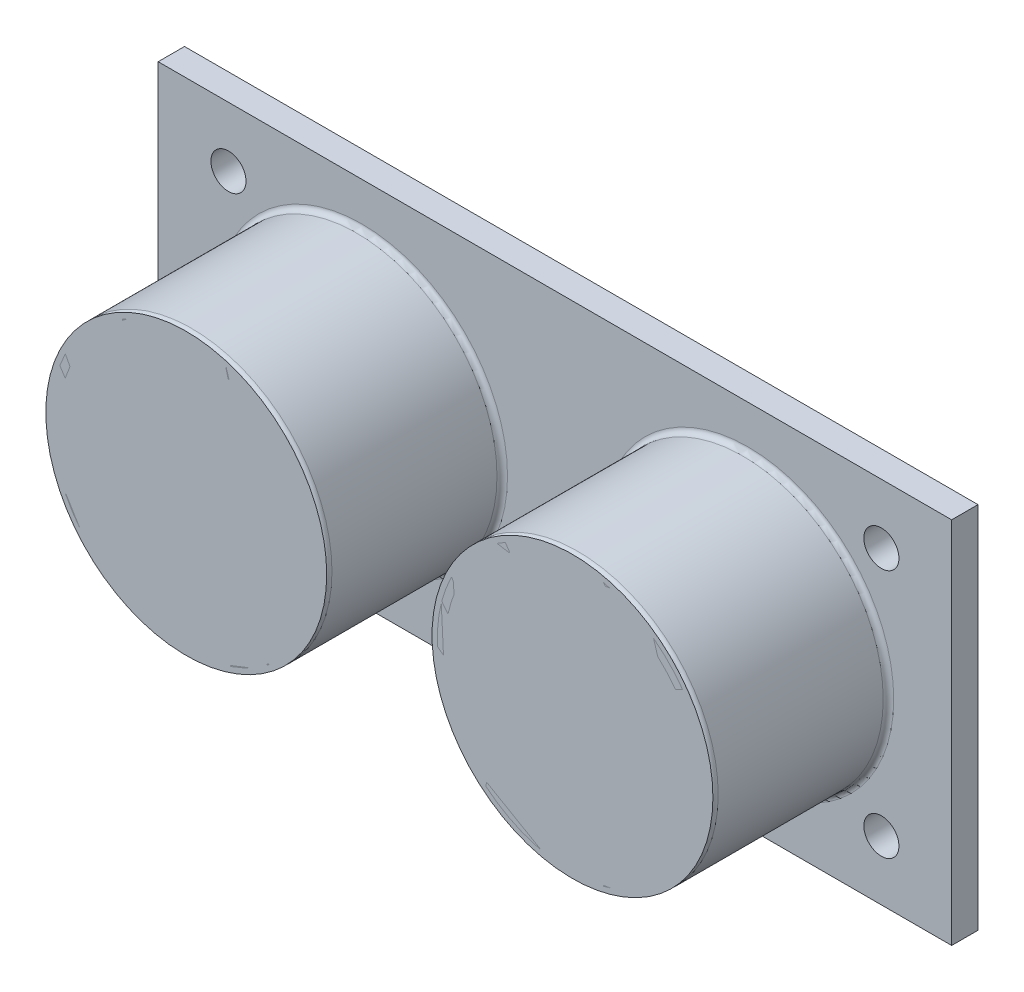
ISO-10303-21;
HEADER;
FILE_DESCRIPTION(('STEP AP214'),'2;1');
FILE_NAME('part.step','',(''),(''),'','','');
FILE_SCHEMA(('AUTOMOTIVE_DESIGN { 1 0 10303 214 1 1 1 1 }'));
ENDSEC;
DATA;
#1=APPLICATION_CONTEXT('core data for automotive mechanical design processes');
#2=APPLICATION_PROTOCOL_DEFINITION('international standard','automotive_design',2000,#1);
#3=PRODUCT_CONTEXT('',#1,'mechanical');
#4=PRODUCT('Part','Part','',(#3));
#5=PRODUCT_RELATED_PRODUCT_CATEGORY('part','',(#4));
#6=PRODUCT_DEFINITION_FORMATION('','',#4);
#7=PRODUCT_DEFINITION_CONTEXT('part definition',#1,'design');
#8=PRODUCT_DEFINITION('design','',#6,#7);
#9=PRODUCT_DEFINITION_SHAPE('','',#8);
#10=(LENGTH_UNIT() NAMED_UNIT(*) SI_UNIT(.MILLI.,.METRE.));
#11=(NAMED_UNIT(*) PLANE_ANGLE_UNIT() SI_UNIT($,.RADIAN.));
#12=(NAMED_UNIT(*) SI_UNIT($,.STERADIAN.) SOLID_ANGLE_UNIT());
#13=UNCERTAINTY_MEASURE_WITH_UNIT(LENGTH_MEASURE(1.E-05),#10,'distance_accuracy_value','');
#14=(GEOMETRIC_REPRESENTATION_CONTEXT(3) GLOBAL_UNCERTAINTY_ASSIGNED_CONTEXT((#13)) GLOBAL_UNIT_ASSIGNED_CONTEXT((#10,
#11,#12)) REPRESENTATION_CONTEXT('',''));
#15=CARTESIAN_POINT('',(0.,0.,0.));
#16=DIRECTION('',(0.,0.,1.));
#17=DIRECTION('',(1.,0.,0.));
#18=AXIS2_PLACEMENT_3D('',#15,#16,#17);
#19=CARTESIAN_POINT('',(0.,0.,10.75));
#20=DIRECTION('',(0.,0.,1.));
#21=DIRECTION('',(1.,0.,0.));
#22=AXIS2_PLACEMENT_3D('',#19,#20,#21);
#23=PLANE('',#22);
#24=CARTESIAN_POINT('',(11.,0.,10.75));
#25=DIRECTION('',(0.,0.,1.));
#26=DIRECTION('',(1.,0.,0.));
#27=AXIS2_PLACEMENT_3D('',#24,#25,#26);
#28=CIRCLE('',#27,8.);
#29=CARTESIAN_POINT('',(19.,0.,10.75));
#30=VERTEX_POINT('',#29);
#31=EDGE_CURVE('E13',#30,#30,#28,.T.);
#32=ORIENTED_EDGE('',*,*,#31,.T.);
#33=EDGE_LOOP('',(#32));
#34=FACE_BOUND('',#33,.T.);
#35=ADVANCED_FACE('F51',(#34),#23,.T.);
#36=OPEN_SHELL('',(#35));
#37=SHELL_BASED_SURFACE_MODEL('B2',(#36));
#38=CARTESIAN_POINT('',(0.,0.,10.75));
#39=DIRECTION('',(0.,0.,1.));
#40=DIRECTION('',(1.,0.,0.));
#41=AXIS2_PLACEMENT_3D('',#38,#39,#40);
#42=PLANE('',#41);
#43=CARTESIAN_POINT('',(-11.,0.,10.75));
#44=DIRECTION('',(0.,0.,1.));
#45=DIRECTION('',(1.,0.,0.));
#46=AXIS2_PLACEMENT_3D('',#43,#44,#45);
#47=CIRCLE('',#46,8.);
#48=CARTESIAN_POINT('',(-3.,0.,10.75));
#49=VERTEX_POINT('',#48);
#50=EDGE_CURVE('E50',#49,#49,#47,.T.);
#51=ORIENTED_EDGE('',*,*,#50,.T.);
#52=EDGE_LOOP('',(#51));
#53=FACE_BOUND('',#52,.T.);
#54=ADVANCED_FACE('F76',(#53),#42,.T.);
#55=OPEN_SHELL('',(#54));
#56=SHELL_BASED_SURFACE_MODEL('B8',(#55));
#57=CARTESIAN_POINT('',(22.6,10.5,0.75));
#58=DIRECTION('',(-1.,0.,0.));
#59=DIRECTION('',(0.,0.,1.));
#60=AXIS2_PLACEMENT_3D('',#57,#58,#59);
#61=PLANE('',#60);
#62=DIRECTION('',(0.,1.,0.));
#63=VECTOR('',#62,1.);
#64=CARTESIAN_POINT('',(22.6,10.5,-0.75));
#65=LINE('',#64,#63);
#66=CARTESIAN_POINT('',(22.6,-10.5,-0.75));
#67=VERTEX_POINT('',#66);
#68=CARTESIAN_POINT('',(22.6,10.5,-0.75));
#69=VERTEX_POINT('',#68);
#70=EDGE_CURVE('E160',#67,#69,#65,.T.);
#71=ORIENTED_EDGE('',*,*,#70,.T.);
#72=DIRECTION('',(0.,0.,-1.));
#73=VECTOR('',#72,1.);
#74=CARTESIAN_POINT('',(22.6,10.5,0.75));
#75=LINE('',#74,#73);
#76=CARTESIAN_POINT('',(22.6,10.5,0.75));
#77=VERTEX_POINT('',#76);
#78=EDGE_CURVE('E151',#77,#69,#75,.T.);
#79=ORIENTED_EDGE('',*,*,#78,.F.);
#80=DIRECTION('',(0.,1.,0.));
#81=VECTOR('',#80,1.);
#82=CARTESIAN_POINT('',(22.6,10.5,0.75));
#83=LINE('',#82,#81);
#84=CARTESIAN_POINT('',(22.6,-10.5,0.75));
#85=VERTEX_POINT('',#84);
#86=EDGE_CURVE('E145',#85,#77,#83,.T.);
#87=ORIENTED_EDGE('',*,*,#86,.F.);
#88=DIRECTION('',(0.,0.,-1.));
#89=VECTOR('',#88,1.);
#90=CARTESIAN_POINT('',(22.6,-10.5,0.75));
#91=LINE('',#90,#89);
#92=EDGE_CURVE('E156',#85,#67,#91,.T.);
#93=ORIENTED_EDGE('',*,*,#92,.T.);
#94=EDGE_LOOP('',(#71,#79,#87,#93));
#95=FACE_BOUND('',#94,.T.);
#96=ADVANCED_FACE('F92',(#95),#61,.F.);
#97=CARTESIAN_POINT('',(-22.6,10.5,0.75));
#98=DIRECTION('',(0.,-1.,0.));
#99=DIRECTION('',(1.,0.,0.));
#100=AXIS2_PLACEMENT_3D('',#97,#98,#99);
#101=PLANE('',#100);
#102=DIRECTION('',(-1.,0.,0.));
#103=VECTOR('',#102,1.);
#104=CARTESIAN_POINT('',(-22.6,10.5,-0.75));
#105=LINE('',#104,#103);
#106=CARTESIAN_POINT('',(-22.6,10.5,-0.75));
#107=VERTEX_POINT('',#106);
#108=EDGE_CURVE('E150',#69,#107,#105,.T.);
#109=ORIENTED_EDGE('',*,*,#108,.T.);
#110=DIRECTION('',(0.,0.,-1.));
#111=VECTOR('',#110,1.);
#112=CARTESIAN_POINT('',(-22.6,10.5,0.75));
#113=LINE('',#112,#111);
#114=CARTESIAN_POINT('',(-22.6,10.5,0.75));
#115=VERTEX_POINT('',#114);
#116=EDGE_CURVE('E148',#115,#107,#113,.T.);
#117=ORIENTED_EDGE('',*,*,#116,.F.);
#118=DIRECTION('',(-1.,0.,0.));
#119=VECTOR('',#118,1.);
#120=CARTESIAN_POINT('',(-22.6,10.5,0.75));
#121=LINE('',#120,#119);
#122=EDGE_CURVE('E140',#77,#115,#121,.T.);
#123=ORIENTED_EDGE('',*,*,#122,.F.);
#124=ORIENTED_EDGE('',*,*,#78,.T.);
#125=EDGE_LOOP('',(#109,#117,#123,#124));
#126=FACE_BOUND('',#125,.T.);
#127=ADVANCED_FACE('F149',(#126),#101,.F.);
#128=CARTESIAN_POINT('',(-22.6,10.5,0.75));
#129=DIRECTION('',(1.,0.,0.));
#130=DIRECTION('',(0.,0.,-1.));
#131=AXIS2_PLACEMENT_3D('',#128,#129,#130);
#132=PLANE('',#131);
#133=DIRECTION('',(0.,-1.,0.));
#134=VECTOR('',#133,1.);
#135=CARTESIAN_POINT('',(-22.6,10.5,-0.75));
#136=LINE('',#135,#134);
#137=CARTESIAN_POINT('',(-22.6,-10.5,-0.75));
#138=VERTEX_POINT('',#137);
#139=EDGE_CURVE('E126',#107,#138,#136,.T.);
#140=ORIENTED_EDGE('',*,*,#139,.T.);
#141=DIRECTION('',(0.,0.,-1.));
#142=VECTOR('',#141,1.);
#143=CARTESIAN_POINT('',(-22.6,-10.5,0.75));
#144=LINE('',#143,#142);
#145=CARTESIAN_POINT('',(-22.6,-10.5,0.75));
#146=VERTEX_POINT('',#145);
#147=EDGE_CURVE('E152',#146,#138,#144,.T.);
#148=ORIENTED_EDGE('',*,*,#147,.F.);
#149=DIRECTION('',(0.,-1.,0.));
#150=VECTOR('',#149,1.);
#151=CARTESIAN_POINT('',(-22.6,10.5,0.75));
#152=LINE('',#151,#150);
#153=EDGE_CURVE('E143',#115,#146,#152,.T.);
#154=ORIENTED_EDGE('',*,*,#153,.F.);
#155=ORIENTED_EDGE('',*,*,#116,.T.);
#156=EDGE_LOOP('',(#140,#148,#154,#155));
#157=FACE_BOUND('',#156,.T.);
#158=ADVANCED_FACE('F154',(#157),#132,.F.);
#159=CARTESIAN_POINT('',(-22.6,-10.5,0.75));
#160=DIRECTION('',(0.,1.,0.));
#161=DIRECTION('',(0.,0.,1.));
#162=AXIS2_PLACEMENT_3D('',#159,#160,#161);
#163=PLANE('',#162);
#164=DIRECTION('',(1.,0.,0.));
#165=VECTOR('',#164,1.);
#166=CARTESIAN_POINT('',(-22.6,-10.5,-0.75));
#167=LINE('',#166,#165);
#168=EDGE_CURVE('E132',#138,#67,#167,.T.);
#169=ORIENTED_EDGE('',*,*,#168,.T.);
#170=ORIENTED_EDGE('',*,*,#92,.F.);
#171=DIRECTION('',(1.,0.,0.));
#172=VECTOR('',#171,1.);
#173=CARTESIAN_POINT('',(-22.6,-10.5,0.75));
#174=LINE('',#173,#172);
#175=EDGE_CURVE('E109',#146,#85,#174,.T.);
#176=ORIENTED_EDGE('',*,*,#175,.F.);
#177=ORIENTED_EDGE('',*,*,#147,.T.);
#178=EDGE_LOOP('',(#169,#170,#176,#177));
#179=FACE_BOUND('',#178,.T.);
#180=ADVANCED_FACE('F249',(#179),#163,.F.);
#181=CARTESIAN_POINT('',(0.,0.,0.75));
#182=DIRECTION('',(0.,0.,1.));
#183=DIRECTION('',(1.,0.,0.));
#184=AXIS2_PLACEMENT_3D('',#181,#182,#183);
#185=PLANE('',#184);
#186=CARTESIAN_POINT('',(11.,0.,0.75));
#187=DIRECTION('',(0.,0.,1.));
#188=DIRECTION('',(1.,0.,0.));
#189=AXIS2_PLACEMENT_3D('',#186,#187,#188);
#190=CIRCLE('',#189,8.3);
#191=CARTESIAN_POINT('',(19.3,0.,0.75));
#192=VERTEX_POINT('',#191);
#193=EDGE_CURVE('E182',#192,#192,#190,.F.);
#194=ORIENTED_EDGE('',*,*,#193,.T.);
#195=EDGE_LOOP('',(#194));
#196=FACE_BOUND('',#195,.T.);
#197=CARTESIAN_POINT('',(-11.,0.,0.75));
#198=DIRECTION('',(0.,0.,1.));
#199=DIRECTION('',(1.,0.,0.));
#200=AXIS2_PLACEMENT_3D('',#197,#198,#199);
#201=CIRCLE('',#200,8.3);
#202=CARTESIAN_POINT('',(-2.7,0.,0.75));
#203=VERTEX_POINT('',#202);
#204=EDGE_CURVE('E179',#203,#203,#201,.F.);
#205=ORIENTED_EDGE('',*,*,#204,.T.);
#206=EDGE_LOOP('',(#205));
#207=FACE_BOUND('',#206,.T.);
#208=CARTESIAN_POINT('',(-18.5965477568025,-7.09919625163283,0.75));
#209=DIRECTION('',(0.,0.,-1.));
#210=DIRECTION('',(1.,0.,0.));
#211=AXIS2_PLACEMENT_3D('',#208,#209,#210);
#212=CIRCLE('',#211,1.);
#213=CARTESIAN_POINT('',(-17.5965477568025,-7.09919625163283,0.75));
#214=VERTEX_POINT('',#213);
#215=EDGE_CURVE('E215',#214,#214,#212,.T.);
#216=ORIENTED_EDGE('',*,*,#215,.T.);
#217=EDGE_LOOP('',(#216));
#218=FACE_BOUND('',#217,.T.);
#219=CARTESIAN_POINT('',(18.5965477568025,-7.09919625163283,0.75));
#220=DIRECTION('',(0.,0.,1.));
#221=DIRECTION('',(-1.,0.,0.));
#222=AXIS2_PLACEMENT_3D('',#219,#220,#221);
#223=CIRCLE('',#222,1.);
#224=CARTESIAN_POINT('',(17.5965477568025,-7.09919625163283,0.75));
#225=VERTEX_POINT('',#224);
#226=EDGE_CURVE('E225',#225,#225,#223,.T.);
#227=ORIENTED_EDGE('',*,*,#226,.F.);
#228=EDGE_LOOP('',(#227));
#229=FACE_BOUND('',#228,.T.);
#230=CARTESIAN_POINT('',(18.5965477568025,7.09919625163283,0.75));
#231=DIRECTION('',(0.,0.,-1.));
#232=DIRECTION('',(-1.,0.,0.));
#233=AXIS2_PLACEMENT_3D('',#230,#231,#232);
#234=CIRCLE('',#233,1.);
#235=CARTESIAN_POINT('',(17.5965477568025,7.09919625163283,0.75));
#236=VERTEX_POINT('',#235);
#237=EDGE_CURVE('E231',#236,#236,#234,.T.);
#238=ORIENTED_EDGE('',*,*,#237,.T.);
#239=EDGE_LOOP('',(#238));
#240=FACE_BOUND('',#239,.T.);
#241=CARTESIAN_POINT('',(-18.5965477568025,7.09919625163283,0.75));
#242=DIRECTION('',(0.,0.,1.));
#243=DIRECTION('',(1.,0.,0.));
#244=AXIS2_PLACEMENT_3D('',#241,#242,#243);
#245=CIRCLE('',#244,1.);
#246=CARTESIAN_POINT('',(-17.5965477568025,7.09919625163283,0.75));
#247=VERTEX_POINT('',#246);
#248=EDGE_CURVE('E237',#247,#247,#245,.T.);
#249=ORIENTED_EDGE('',*,*,#248,.F.);
#250=EDGE_LOOP('',(#249));
#251=FACE_BOUND('',#250,.T.);
#252=ORIENTED_EDGE('',*,*,#86,.T.);
#253=ORIENTED_EDGE('',*,*,#122,.T.);
#254=ORIENTED_EDGE('',*,*,#153,.T.);
#255=ORIENTED_EDGE('',*,*,#175,.T.);
#256=EDGE_LOOP('',(#252,#253,#254,#255));
#257=FACE_BOUND('',#256,.T.);
#258=ADVANCED_FACE('F141',(#196,#207,#218,#229,#240,#251,#257),#185,.T.);
#259=CARTESIAN_POINT('',(0.,0.,-0.75));
#260=DIRECTION('',(0.,0.,1.));
#261=DIRECTION('',(1.,0.,0.));
#262=AXIS2_PLACEMENT_3D('',#259,#260,#261);
#263=PLANE('',#262);
#264=CARTESIAN_POINT('',(-18.5965477568025,-7.09919625163283,-0.75));
#265=DIRECTION('',(0.,0.,-1.));
#266=DIRECTION('',(1.,0.,0.));
#267=AXIS2_PLACEMENT_3D('',#264,#265,#266);
#268=CIRCLE('',#267,1.);
#269=CARTESIAN_POINT('',(-17.5965477568025,-7.09919625163283,-0.75));
#270=VERTEX_POINT('',#269);
#271=EDGE_CURVE('E222',#270,#270,#268,.T.);
#272=ORIENTED_EDGE('',*,*,#271,.F.);
#273=EDGE_LOOP('',(#272));
#274=FACE_BOUND('',#273,.T.);
#275=CARTESIAN_POINT('',(18.5965477568025,-7.09919625163283,-0.75));
#276=DIRECTION('',(0.,0.,1.));
#277=DIRECTION('',(-1.,0.,0.));
#278=AXIS2_PLACEMENT_3D('',#275,#276,#277);
#279=CIRCLE('',#278,1.);
#280=CARTESIAN_POINT('',(17.5965477568025,-7.09919625163283,-0.75));
#281=VERTEX_POINT('',#280);
#282=EDGE_CURVE('E228',#281,#281,#279,.T.);
#283=ORIENTED_EDGE('',*,*,#282,.T.);
#284=EDGE_LOOP('',(#283));
#285=FACE_BOUND('',#284,.T.);
#286=CARTESIAN_POINT('',(18.5965477568025,7.09919625163283,-0.75));
#287=DIRECTION('',(0.,0.,-1.));
#288=DIRECTION('',(-1.,0.,0.));
#289=AXIS2_PLACEMENT_3D('',#286,#287,#288);
#290=CIRCLE('',#289,1.);
#291=CARTESIAN_POINT('',(17.5965477568025,7.09919625163283,-0.75));
#292=VERTEX_POINT('',#291);
#293=EDGE_CURVE('E234',#292,#292,#290,.T.);
#294=ORIENTED_EDGE('',*,*,#293,.F.);
#295=EDGE_LOOP('',(#294));
#296=FACE_BOUND('',#295,.T.);
#297=CARTESIAN_POINT('',(-18.5965477568025,7.09919625163283,-0.75));
#298=DIRECTION('',(0.,0.,1.));
#299=DIRECTION('',(1.,0.,0.));
#300=AXIS2_PLACEMENT_3D('',#297,#298,#299);
#301=CIRCLE('',#300,1.);
#302=CARTESIAN_POINT('',(-17.5965477568025,7.09919625163283,-0.75));
#303=VERTEX_POINT('',#302);
#304=EDGE_CURVE('E163',#303,#303,#301,.T.);
#305=ORIENTED_EDGE('',*,*,#304,.T.);
#306=EDGE_LOOP('',(#305));
#307=FACE_BOUND('',#306,.T.);
#308=ORIENTED_EDGE('',*,*,#70,.F.);
#309=ORIENTED_EDGE('',*,*,#168,.F.);
#310=ORIENTED_EDGE('',*,*,#139,.F.);
#311=ORIENTED_EDGE('',*,*,#108,.F.);
#312=EDGE_LOOP('',(#308,#309,#310,#311));
#313=FACE_BOUND('',#312,.T.);
#314=ADVANCED_FACE('F248',(#274,#285,#296,#307,#313),#263,.F.);
#315=CARTESIAN_POINT('',(-18.5965477568025,7.09919625163283,-0.75));
#316=DIRECTION('',(0.,0.,1.));
#317=DIRECTION('',(1.,0.,0.));
#318=AXIS2_PLACEMENT_3D('',#315,#316,#317);
#319=CYLINDRICAL_SURFACE('',#318,1.);
#320=ORIENTED_EDGE('',*,*,#304,.F.);
#321=EDGE_LOOP('',(#320));
#322=FACE_BOUND('',#321,.T.);
#323=ORIENTED_EDGE('',*,*,#248,.T.);
#324=EDGE_LOOP('',(#323));
#325=FACE_BOUND('',#324,.T.);
#326=ADVANCED_FACE('F245',(#322,#325),#319,.F.);
#327=CARTESIAN_POINT('',(18.5965477568025,7.09919625163283,-0.75));
#328=DIRECTION('',(0.,0.,1.));
#329=DIRECTION('',(1.,0.,0.));
#330=AXIS2_PLACEMENT_3D('',#327,#328,#329);
#331=CYLINDRICAL_SURFACE('',#330,1.);
#332=ORIENTED_EDGE('',*,*,#293,.T.);
#333=EDGE_LOOP('',(#332));
#334=FACE_BOUND('',#333,.T.);
#335=ORIENTED_EDGE('',*,*,#237,.F.);
#336=EDGE_LOOP('',(#335));
#337=FACE_BOUND('',#336,.T.);
#338=ADVANCED_FACE('F312',(#334,#337),#331,.F.);
#339=CARTESIAN_POINT('',(18.5965477568025,-7.09919625163283,-0.75));
#340=DIRECTION('',(0.,0.,1.));
#341=DIRECTION('',(1.,0.,0.));
#342=AXIS2_PLACEMENT_3D('',#339,#340,#341);
#343=CYLINDRICAL_SURFACE('',#342,1.);
#344=ORIENTED_EDGE('',*,*,#282,.F.);
#345=EDGE_LOOP('',(#344));
#346=FACE_BOUND('',#345,.T.);
#347=ORIENTED_EDGE('',*,*,#226,.T.);
#348=EDGE_LOOP('',(#347));
#349=FACE_BOUND('',#348,.T.);
#350=ADVANCED_FACE('F308',(#346,#349),#343,.F.);
#351=CARTESIAN_POINT('',(-18.5965477568025,-7.09919625163283,-0.75));
#352=DIRECTION('',(0.,0.,1.));
#353=DIRECTION('',(1.,0.,0.));
#354=AXIS2_PLACEMENT_3D('',#351,#352,#353);
#355=CYLINDRICAL_SURFACE('',#354,1.);
#356=ORIENTED_EDGE('',*,*,#271,.T.);
#357=EDGE_LOOP('',(#356));
#358=FACE_BOUND('',#357,.T.);
#359=ORIENTED_EDGE('',*,*,#215,.F.);
#360=EDGE_LOOP('',(#359));
#361=FACE_BOUND('',#360,.T.);
#362=ADVANCED_FACE('F305',(#358,#361),#355,.F.);
#363=CARTESIAN_POINT('',(-11.,0.,10.75));
#364=DIRECTION('',(0.,0.,-1.));
#365=DIRECTION('',(-1.,0.,0.));
#366=AXIS2_PLACEMENT_3D('',#363,#364,#365);
#367=CYLINDRICAL_SURFACE('',#366,8.);
#368=CARTESIAN_POINT('',(-11.,0.,10.45));
#369=DIRECTION('',(0.,0.,1.));
#370=DIRECTION('',(1.,0.,0.));
#371=AXIS2_PLACEMENT_3D('',#368,#369,#370);
#372=CIRCLE('',#371,8.);
#373=CARTESIAN_POINT('',(-3.,0.,10.45));
#374=VERTEX_POINT('',#373);
#375=EDGE_CURVE('E101',#374,#374,#372,.F.);
#376=ORIENTED_EDGE('',*,*,#375,.T.);
#377=EDGE_LOOP('',(#376));
#378=FACE_BOUND('',#377,.T.);
#379=CARTESIAN_POINT('',(-11.,0.,1.05));
#380=DIRECTION('',(0.,0.,1.));
#381=DIRECTION('',(1.,0.,0.));
#382=AXIS2_PLACEMENT_3D('',#379,#380,#381);
#383=CIRCLE('',#382,8.);
#384=CARTESIAN_POINT('',(-3.,0.,1.05));
#385=VERTEX_POINT('',#384);
#386=EDGE_CURVE('E188',#385,#385,#383,.T.);
#387=ORIENTED_EDGE('',*,*,#386,.T.);
#388=EDGE_LOOP('',(#387));
#389=FACE_BOUND('',#388,.T.);
#390=ADVANCED_FACE('F193',(#378,#389),#367,.T.);
#391=CARTESIAN_POINT('',(-11.,0.,10.75));
#392=DIRECTION('',(0.,0.,1.));
#393=DIRECTION('',(1.,0.,0.));
#394=AXIS2_PLACEMENT_3D('',#391,#392,#393);
#395=PLANE('',#394);
#396=CARTESIAN_POINT('',(-11.,0.,10.75));
#397=DIRECTION('',(0.,0.,1.));
#398=DIRECTION('',(1.,0.,0.));
#399=AXIS2_PLACEMENT_3D('',#396,#397,#398);
#400=CIRCLE('',#399,7.7);
#401=CARTESIAN_POINT('',(-3.3,0.,10.75));
#402=VERTEX_POINT('',#401);
#403=EDGE_CURVE('E185',#402,#402,#400,.T.);
#404=ORIENTED_EDGE('',*,*,#403,.T.);
#405=EDGE_LOOP('',(#404));
#406=FACE_BOUND('',#405,.T.);
#407=CARTESIAN_POINT('',(-11.,0.,10.75));
#408=DIRECTION('',(0.,0.,1.));
#409=DIRECTION('',(1.,0.,0.));
#410=AXIS2_PLACEMENT_3D('',#407,#408,#409);
#411=CIRCLE('',#410,7.25);
#412=CARTESIAN_POINT('',(-3.75,0.,10.75));
#413=VERTEX_POINT('',#412);
#414=EDGE_CURVE('E209',#413,#413,#411,.T.);
#415=ORIENTED_EDGE('',*,*,#414,.F.);
#416=EDGE_LOOP('',(#415));
#417=FACE_BOUND('',#416,.T.);
#418=ADVANCED_FACE('F202',(#406,#417),#395,.T.);
#419=CARTESIAN_POINT('',(-11.,0.,2.75));
#420=DIRECTION('',(0.,0.,1.));
#421=DIRECTION('',(1.,0.,0.));
#422=AXIS2_PLACEMENT_3D('',#419,#420,#421);
#423=CYLINDRICAL_SURFACE('',#422,7.25);
#424=CARTESIAN_POINT('',(-11.,0.,2.75));
#425=DIRECTION('',(0.,0.,1.));
#426=DIRECTION('',(1.,0.,0.));
#427=AXIS2_PLACEMENT_3D('',#424,#425,#426);
#428=CIRCLE('',#427,7.25);
#429=CARTESIAN_POINT('',(-3.75,0.,2.75));
#430=VERTEX_POINT('',#429);
#431=EDGE_CURVE('E211',#430,#430,#428,.T.);
#432=ORIENTED_EDGE('',*,*,#431,.F.);
#433=EDGE_LOOP('',(#432));
#434=FACE_BOUND('',#433,.T.);
#435=ORIENTED_EDGE('',*,*,#414,.T.);
#436=EDGE_LOOP('',(#435));
#437=FACE_BOUND('',#436,.T.);
#438=ADVANCED_FACE('F205',(#434,#437),#423,.F.);
#439=CARTESIAN_POINT('',(-11.,0.,2.75));
#440=DIRECTION('',(0.,0.,1.));
#441=DIRECTION('',(1.,0.,0.));
#442=AXIS2_PLACEMENT_3D('',#439,#440,#441);
#443=PLANE('',#442);
#444=CARTESIAN_POINT('',(-11.,0.,2.75));
#445=DIRECTION('',(0.,0.,1.));
#446=DIRECTION('',(1.,0.,0.));
#447=AXIS2_PLACEMENT_3D('',#444,#445,#446);
#448=CIRCLE('',#447,5.6);
#449=CARTESIAN_POINT('',(-5.4,0.,2.75));
#450=VERTEX_POINT('',#449);
#451=EDGE_CURVE('E430',#450,#450,#448,.T.);
#452=ORIENTED_EDGE('',*,*,#451,.F.);
#453=EDGE_LOOP('',(#452));
#454=FACE_BOUND('',#453,.T.);
#455=ORIENTED_EDGE('',*,*,#431,.T.);
#456=EDGE_LOOP('',(#455));
#457=FACE_BOUND('',#456,.T.);
#458=ADVANCED_FACE('F286',(#454,#457),#443,.T.);
#459=CARTESIAN_POINT('',(11.,0.,10.75));
#460=DIRECTION('',(0.,0.,-1.));
#461=DIRECTION('',(-1.,0.,0.));
#462=AXIS2_PLACEMENT_3D('',#459,#460,#461);
#463=CYLINDRICAL_SURFACE('',#462,8.);
#464=CARTESIAN_POINT('',(11.,0.,10.45));
#465=DIRECTION('',(0.,0.,1.));
#466=DIRECTION('',(1.,0.,0.));
#467=AXIS2_PLACEMENT_3D('',#464,#465,#466);
#468=CIRCLE('',#467,8.);
#469=CARTESIAN_POINT('',(19.,0.,10.45));
#470=VERTEX_POINT('',#469);
#471=EDGE_CURVE('E173',#470,#470,#468,.F.);
#472=ORIENTED_EDGE('',*,*,#471,.T.);
#473=EDGE_LOOP('',(#472));
#474=FACE_BOUND('',#473,.T.);
#475=CARTESIAN_POINT('',(11.,0.,1.05));
#476=DIRECTION('',(0.,0.,1.));
#477=DIRECTION('',(1.,0.,0.));
#478=AXIS2_PLACEMENT_3D('',#475,#476,#477);
#479=CIRCLE('',#478,8.);
#480=CARTESIAN_POINT('',(19.,0.,1.05));
#481=VERTEX_POINT('',#480);
#482=EDGE_CURVE('E170',#481,#481,#479,.T.);
#483=ORIENTED_EDGE('',*,*,#482,.T.);
#484=EDGE_LOOP('',(#483));
#485=FACE_BOUND('',#484,.T.);
#486=ADVANCED_FACE('F283',(#474,#485),#463,.T.);
#487=CARTESIAN_POINT('',(11.,0.,10.75));
#488=DIRECTION('',(0.,0.,1.));
#489=DIRECTION('',(-1.,0.,0.));
#490=AXIS2_PLACEMENT_3D('',#487,#488,#489);
#491=PLANE('',#490);
#492=CARTESIAN_POINT('',(11.,0.,10.75));
#493=DIRECTION('',(0.,0.,1.));
#494=DIRECTION('',(1.,0.,0.));
#495=AXIS2_PLACEMENT_3D('',#492,#493,#494);
#496=CIRCLE('',#495,7.7);
#497=CARTESIAN_POINT('',(18.7,0.,10.75));
#498=VERTEX_POINT('',#497);
#499=EDGE_CURVE('E176',#498,#498,#496,.T.);
#500=ORIENTED_EDGE('',*,*,#499,.T.);
#501=EDGE_LOOP('',(#500));
#502=FACE_BOUND('',#501,.T.);
#503=CARTESIAN_POINT('',(11.,0.,10.75));
#504=DIRECTION('',(0.,0.,-1.));
#505=DIRECTION('',(-1.,0.,0.));
#506=AXIS2_PLACEMENT_3D('',#503,#504,#505);
#507=CIRCLE('',#506,7.25);
#508=CARTESIAN_POINT('',(3.75,0.,10.75));
#509=VERTEX_POINT('',#508);
#510=EDGE_CURVE('E218',#509,#509,#507,.T.);
#511=ORIENTED_EDGE('',*,*,#510,.T.);
#512=EDGE_LOOP('',(#511));
#513=FACE_BOUND('',#512,.T.);
#514=ADVANCED_FACE('F285',(#502,#513),#491,.T.);
#515=CARTESIAN_POINT('',(11.,0.,2.75));
#516=DIRECTION('',(0.,0.,1.));
#517=DIRECTION('',(1.,0.,0.));
#518=AXIS2_PLACEMENT_3D('',#515,#516,#517);
#519=CYLINDRICAL_SURFACE('',#518,7.25);
#520=CARTESIAN_POINT('',(11.,0.,2.75));
#521=DIRECTION('',(0.,0.,-1.));
#522=DIRECTION('',(-1.,0.,0.));
#523=AXIS2_PLACEMENT_3D('',#520,#521,#522);
#524=CIRCLE('',#523,7.25);
#525=CARTESIAN_POINT('',(3.75,0.,2.75));
#526=VERTEX_POINT('',#525);
#527=EDGE_CURVE('E212',#526,#526,#524,.T.);
#528=ORIENTED_EDGE('',*,*,#527,.T.);
#529=EDGE_LOOP('',(#528));
#530=FACE_BOUND('',#529,.T.);
#531=ORIENTED_EDGE('',*,*,#510,.F.);
#532=EDGE_LOOP('',(#531));
#533=FACE_BOUND('',#532,.T.);
#534=ADVANCED_FACE('F293',(#530,#533),#519,.F.);
#535=CARTESIAN_POINT('',(11.,0.,2.75));
#536=DIRECTION('',(0.,0.,1.));
#537=DIRECTION('',(-1.,0.,0.));
#538=AXIS2_PLACEMENT_3D('',#535,#536,#537);
#539=PLANE('',#538);
#540=CARTESIAN_POINT('',(11.,0.,2.75));
#541=DIRECTION('',(0.,0.,1.));
#542=DIRECTION('',(1.,0.,0.));
#543=AXIS2_PLACEMENT_3D('',#540,#541,#542);
#544=CIRCLE('',#543,5.6);
#545=CARTESIAN_POINT('',(16.6,0.,2.75));
#546=VERTEX_POINT('',#545);
#547=EDGE_CURVE('E74',#546,#546,#544,.T.);
#548=ORIENTED_EDGE('',*,*,#547,.F.);
#549=EDGE_LOOP('',(#548));
#550=FACE_BOUND('',#549,.T.);
#551=ORIENTED_EDGE('',*,*,#527,.F.);
#552=EDGE_LOOP('',(#551));
#553=FACE_BOUND('',#552,.T.);
#554=ADVANCED_FACE('F273',(#550,#553),#539,.T.);
#555=CARTESIAN_POINT('',(11.,0.,10.45));
#556=DIRECTION('',(0.,0.,1.));
#557=DIRECTION('',(1.,0.,0.));
#558=AXIS2_PLACEMENT_3D('',#555,#556,#557);
#559=TOROIDAL_SURFACE('',#558,7.7,0.3);
#560=ORIENTED_EDGE('',*,*,#499,.F.);
#561=EDGE_LOOP('',(#560));
#562=FACE_BOUND('',#561,.T.);
#563=ORIENTED_EDGE('',*,*,#471,.F.);
#564=EDGE_LOOP('',(#563));
#565=FACE_BOUND('',#564,.T.);
#566=ADVANCED_FACE('F270',(#562,#565),#559,.T.);
#567=CARTESIAN_POINT('',(11.,0.,1.05));
#568=DIRECTION('',(0.,0.,1.));
#569=DIRECTION('',(1.,0.,0.));
#570=AXIS2_PLACEMENT_3D('',#567,#568,#569);
#571=TOROIDAL_SURFACE('',#570,8.3,0.3);
#572=ORIENTED_EDGE('',*,*,#193,.F.);
#573=EDGE_LOOP('',(#572));
#574=FACE_BOUND('',#573,.T.);
#575=ORIENTED_EDGE('',*,*,#482,.F.);
#576=EDGE_LOOP('',(#575));
#577=FACE_BOUND('',#576,.T.);
#578=ADVANCED_FACE('F199',(#574,#577),#571,.F.);
#579=CARTESIAN_POINT('',(-11.,0.,10.45));
#580=DIRECTION('',(0.,0.,1.));
#581=DIRECTION('',(1.,0.,0.));
#582=AXIS2_PLACEMENT_3D('',#579,#580,#581);
#583=TOROIDAL_SURFACE('',#582,7.7,0.3);
#584=ORIENTED_EDGE('',*,*,#375,.F.);
#585=EDGE_LOOP('',(#584));
#586=FACE_BOUND('',#585,.T.);
#587=ORIENTED_EDGE('',*,*,#403,.F.);
#588=EDGE_LOOP('',(#587));
#589=FACE_BOUND('',#588,.T.);
#590=ADVANCED_FACE('F196',(#586,#589),#583,.T.);
#591=CARTESIAN_POINT('',(-11.,0.,1.05));
#592=DIRECTION('',(0.,0.,1.));
#593=DIRECTION('',(1.,0.,0.));
#594=AXIS2_PLACEMENT_3D('',#591,#592,#593);
#595=TOROIDAL_SURFACE('',#594,8.3,0.3);
#596=ORIENTED_EDGE('',*,*,#204,.F.);
#597=EDGE_LOOP('',(#596));
#598=FACE_BOUND('',#597,.T.);
#599=ORIENTED_EDGE('',*,*,#386,.F.);
#600=EDGE_LOOP('',(#599));
#601=FACE_BOUND('',#600,.T.);
#602=ADVANCED_FACE('F94',(#598,#601),#595,.F.);
#603=CARTESIAN_POINT('',(-11.,0.,6.75));
#604=DIRECTION('',(0.,0.,-1.));
#605=DIRECTION('',(-1.,0.,0.));
#606=AXIS2_PLACEMENT_3D('',#603,#604,#605);
#607=CYLINDRICAL_SURFACE('',#606,5.6);
#608=CARTESIAN_POINT('',(-11.,0.,6.75));
#609=DIRECTION('',(0.,0.,1.));
#610=DIRECTION('',(1.,0.,0.));
#611=AXIS2_PLACEMENT_3D('',#608,#609,#610);
#612=CIRCLE('',#611,5.6);
#613=CARTESIAN_POINT('',(-5.4,0.,6.75));
#614=VERTEX_POINT('',#613);
#615=EDGE_CURVE('E428',#614,#614,#612,.T.);
#616=ORIENTED_EDGE('',*,*,#615,.F.);
#617=EDGE_LOOP('',(#616));
#618=FACE_BOUND('',#617,.T.);
#619=ORIENTED_EDGE('',*,*,#451,.T.);
#620=EDGE_LOOP('',(#619));
#621=FACE_BOUND('',#620,.T.);
#622=ADVANCED_FACE('F369',(#618,#621),#607,.T.);
#623=CARTESIAN_POINT('',(-11.,0.,6.75));
#624=DIRECTION('',(0.,0.,1.));
#625=DIRECTION('',(1.,0.,0.));
#626=AXIS2_PLACEMENT_3D('',#623,#624,#625);
#627=PLANE('',#626);
#628=ORIENTED_EDGE('',*,*,#615,.T.);
#629=EDGE_LOOP('',(#628));
#630=FACE_BOUND('',#629,.T.);
#631=ADVANCED_FACE('F374',(#630),#627,.T.);
#632=CARTESIAN_POINT('',(11.,0.,6.75));
#633=DIRECTION('',(0.,0.,-1.));
#634=DIRECTION('',(-1.,0.,0.));
#635=AXIS2_PLACEMENT_3D('',#632,#633,#634);
#636=CYLINDRICAL_SURFACE('',#635,5.6);
#637=CARTESIAN_POINT('',(11.,0.,6.75));
#638=DIRECTION('',(0.,0.,-1.));
#639=DIRECTION('',(-1.,0.,0.));
#640=AXIS2_PLACEMENT_3D('',#637,#638,#639);
#641=CIRCLE('',#640,5.6);
#642=CARTESIAN_POINT('',(5.4,0.,6.75));
#643=VERTEX_POINT('',#642);
#644=EDGE_CURVE('E434',#643,#643,#641,.T.);
#645=ORIENTED_EDGE('',*,*,#644,.T.);
#646=EDGE_LOOP('',(#645));
#647=FACE_BOUND('',#646,.T.);
#648=ORIENTED_EDGE('',*,*,#547,.T.);
#649=EDGE_LOOP('',(#648));
#650=FACE_BOUND('',#649,.T.);
#651=ADVANCED_FACE('F384',(#647,#650),#636,.T.);
#652=CARTESIAN_POINT('',(11.,0.,6.75));
#653=DIRECTION('',(0.,0.,1.));
#654=DIRECTION('',(-1.,0.,0.));
#655=AXIS2_PLACEMENT_3D('',#652,#653,#654);
#656=PLANE('',#655);
#657=ORIENTED_EDGE('',*,*,#644,.F.);
#658=EDGE_LOOP('',(#657));
#659=FACE_BOUND('',#658,.T.);
#660=ADVANCED_FACE('F406',(#659),#656,.T.);
#661=CLOSED_SHELL('',(#96,#127,#158,#180,#258,#314,#326,#338,#350,#362,#390,#418,#438,#458,#486,
#514,#534,#554,#566,#578,#590,#602,#622,#631,#651,#660));
#662=MANIFOLD_SOLID_BREP('B45',#661);
#663=ADVANCED_BREP_SHAPE_REPRESENTATION('',(#18,#662),#14);
#664=MANIFOLD_SURFACE_SHAPE_REPRESENTATION('',(#18,#37,#56),#14);
#665=SHAPE_REPRESENTATION('',(#18),#14);
#666=SHAPE_DEFINITION_REPRESENTATION(#9,#665);
#667=SHAPE_REPRESENTATION_RELATIONSHIP('','',#665,#663);
#668=SHAPE_REPRESENTATION_RELATIONSHIP('','',#665,#664);
ENDSEC;
END-ISO-10303-21;
